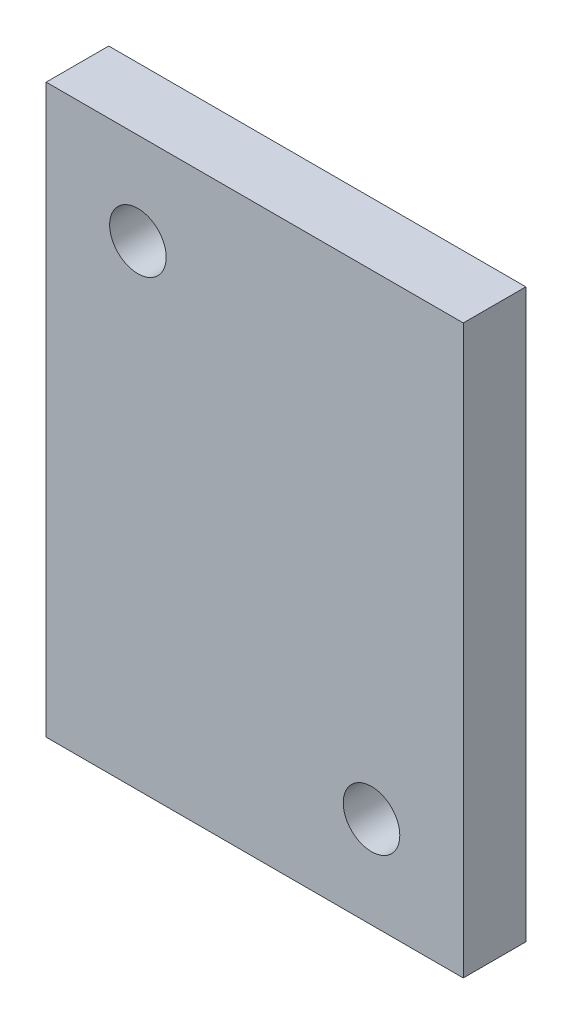
ISO-10303-21;
HEADER;
FILE_DESCRIPTION(('STEP AP214'),'2;1');
FILE_NAME('part.step','',(''),(''),'','','');
FILE_SCHEMA(('AUTOMOTIVE_DESIGN { 1 0 10303 214 1 1 1 1 }'));
ENDSEC;
DATA;
#1=APPLICATION_CONTEXT('core data for automotive mechanical design processes');
#2=APPLICATION_PROTOCOL_DEFINITION('international standard','automotive_design',2000,#1);
#3=PRODUCT_CONTEXT('',#1,'mechanical');
#4=PRODUCT('Part','Part','',(#3));
#5=PRODUCT_RELATED_PRODUCT_CATEGORY('part','',(#4));
#6=PRODUCT_DEFINITION_FORMATION('','',#4);
#7=PRODUCT_DEFINITION_CONTEXT('part definition',#1,'design');
#8=PRODUCT_DEFINITION('design','',#6,#7);
#9=PRODUCT_DEFINITION_SHAPE('','',#8);
#10=(LENGTH_UNIT() NAMED_UNIT(*) SI_UNIT(.MILLI.,.METRE.));
#11=(NAMED_UNIT(*) PLANE_ANGLE_UNIT() SI_UNIT($,.RADIAN.));
#12=(NAMED_UNIT(*) SI_UNIT($,.STERADIAN.) SOLID_ANGLE_UNIT());
#13=UNCERTAINTY_MEASURE_WITH_UNIT(LENGTH_MEASURE(1.E-05),#10,'distance_accuracy_value','');
#14=(GEOMETRIC_REPRESENTATION_CONTEXT(3) GLOBAL_UNCERTAINTY_ASSIGNED_CONTEXT((#13)) GLOBAL_UNIT_ASSIGNED_CONTEXT((#10,
#11,#12)) REPRESENTATION_CONTEXT('',''));
#15=CARTESIAN_POINT('',(0.,0.,0.));
#16=DIRECTION('',(0.,0.,1.));
#17=DIRECTION('',(1.,0.,0.));
#18=AXIS2_PLACEMENT_3D('',#15,#16,#17);
#19=CARTESIAN_POINT('',(-3069.40875716416,1119.82069471238,4.7625));
#20=DIRECTION('',(0.,-1.,0.));
#21=DIRECTION('',(0.,0.,-1.));
#22=AXIS2_PLACEMENT_3D('',#19,#20,#21);
#23=PLANE('',#22);
#24=DIRECTION('',(-1.,0.,0.));
#25=VECTOR('',#24,1.);
#26=CARTESIAN_POINT('',(-3069.40875716416,1119.82069471238,0.));
#27=LINE('',#26,#25);
#28=CARTESIAN_POINT('',(-3069.40875716416,1119.82069471238,0.));
#29=VERTEX_POINT('',#28);
#30=CARTESIAN_POINT('',(-3101.15875716416,1119.82069471238,0.));
#31=VERTEX_POINT('',#30);
#32=EDGE_CURVE('E95',#29,#31,#27,.T.);
#33=ORIENTED_EDGE('',*,*,#32,.T.);
#34=DIRECTION('',(0.,0.,-1.));
#35=VECTOR('',#34,1.);
#36=CARTESIAN_POINT('',(-3101.15875716416,1119.82069471238,4.7625));
#37=LINE('',#36,#35);
#38=CARTESIAN_POINT('',(-3101.15875716416,1119.82069471238,4.7625));
#39=VERTEX_POINT('',#38);
#40=EDGE_CURVE('E11',#39,#31,#37,.T.);
#41=ORIENTED_EDGE('',*,*,#40,.F.);
#42=DIRECTION('',(-1.,0.,0.));
#43=VECTOR('',#42,1.);
#44=CARTESIAN_POINT('',(-3069.40875716416,1119.82069471238,4.7625));
#45=LINE('',#44,#43);
#46=CARTESIAN_POINT('',(-3069.40875716416,1119.82069471238,4.7625));
#47=VERTEX_POINT('',#46);
#48=EDGE_CURVE('E83',#47,#39,#45,.T.);
#49=ORIENTED_EDGE('',*,*,#48,.F.);
#50=DIRECTION('',(0.,0.,-1.));
#51=VECTOR('',#50,1.);
#52=CARTESIAN_POINT('',(-3069.40875716416,1119.82069471238,4.7625));
#53=LINE('',#52,#51);
#54=EDGE_CURVE('E91',#47,#29,#53,.T.);
#55=ORIENTED_EDGE('',*,*,#54,.T.);
#56=EDGE_LOOP('',(#33,#41,#49,#55));
#57=FACE_BOUND('',#56,.T.);
#58=ADVANCED_FACE('F32',(#57),#23,.F.);
#59=CARTESIAN_POINT('',(-3101.15875716416,1119.82069471238,4.7625));
#60=DIRECTION('',(1.,0.,0.));
#61=DIRECTION('',(0.,0.,-1.));
#62=AXIS2_PLACEMENT_3D('',#59,#60,#61);
#63=PLANE('',#62);
#64=DIRECTION('',(0.,-1.,0.));
#65=VECTOR('',#64,1.);
#66=CARTESIAN_POINT('',(-3101.15875716416,1119.82069471238,0.));
#67=LINE('',#66,#65);
#68=CARTESIAN_POINT('',(-3101.15875716416,1076.64069471238,0.));
#69=VERTEX_POINT('',#68);
#70=EDGE_CURVE('E87',#31,#69,#67,.T.);
#71=ORIENTED_EDGE('',*,*,#70,.T.);
#72=DIRECTION('',(0.,0.,-1.));
#73=VECTOR('',#72,1.);
#74=CARTESIAN_POINT('',(-3101.15875716416,1076.64069471238,4.7625));
#75=LINE('',#74,#73);
#76=CARTESIAN_POINT('',(-3101.15875716416,1076.64069471238,4.7625));
#77=VERTEX_POINT('',#76);
#78=EDGE_CURVE('E40',#77,#69,#75,.T.);
#79=ORIENTED_EDGE('',*,*,#78,.F.);
#80=DIRECTION('',(0.,-1.,0.));
#81=VECTOR('',#80,1.);
#82=CARTESIAN_POINT('',(-3101.15875716416,1119.82069471238,4.7625));
#83=LINE('',#82,#81);
#84=EDGE_CURVE('E78',#39,#77,#83,.T.);
#85=ORIENTED_EDGE('',*,*,#84,.F.);
#86=ORIENTED_EDGE('',*,*,#40,.T.);
#87=EDGE_LOOP('',(#71,#79,#85,#86));
#88=FACE_BOUND('',#87,.T.);
#89=ADVANCED_FACE('F86',(#88),#63,.F.);
#90=CARTESIAN_POINT('',(-3101.15875716416,1076.64069471238,4.7625));
#91=DIRECTION('',(0.,1.,0.));
#92=DIRECTION('',(0.,0.,1.));
#93=AXIS2_PLACEMENT_3D('',#90,#91,#92);
#94=PLANE('',#93);
#95=DIRECTION('',(1.,0.,0.));
#96=VECTOR('',#95,1.);
#97=CARTESIAN_POINT('',(-3101.15875716416,1076.64069471238,0.));
#98=LINE('',#97,#96);
#99=CARTESIAN_POINT('',(-3069.40875716416,1076.64069471238,0.));
#100=VERTEX_POINT('',#99);
#101=EDGE_CURVE('E65',#69,#100,#98,.T.);
#102=ORIENTED_EDGE('',*,*,#101,.T.);
#103=DIRECTION('',(0.,0.,-1.));
#104=VECTOR('',#103,1.);
#105=CARTESIAN_POINT('',(-3069.40875716416,1076.64069471238,4.7625));
#106=LINE('',#105,#104);
#107=CARTESIAN_POINT('',(-3069.40875716416,1076.64069471238,4.7625));
#108=VERTEX_POINT('',#107);
#109=EDGE_CURVE('E88',#108,#100,#106,.T.);
#110=ORIENTED_EDGE('',*,*,#109,.F.);
#111=DIRECTION('',(1.,0.,0.));
#112=VECTOR('',#111,1.);
#113=CARTESIAN_POINT('',(-3101.15875716416,1076.64069471238,4.7625));
#114=LINE('',#113,#112);
#115=EDGE_CURVE('E81',#77,#108,#114,.T.);
#116=ORIENTED_EDGE('',*,*,#115,.F.);
#117=ORIENTED_EDGE('',*,*,#78,.T.);
#118=EDGE_LOOP('',(#102,#110,#116,#117));
#119=FACE_BOUND('',#118,.T.);
#120=ADVANCED_FACE('F89',(#119),#94,.F.);
#121=CARTESIAN_POINT('',(-3069.40875716416,1076.64069471238,4.7625));
#122=DIRECTION('',(-1.,0.,0.));
#123=DIRECTION('',(0.,0.,1.));
#124=AXIS2_PLACEMENT_3D('',#121,#122,#123);
#125=PLANE('',#124);
#126=DIRECTION('',(0.,1.,0.));
#127=VECTOR('',#126,1.);
#128=CARTESIAN_POINT('',(-3069.40875716416,1076.64069471238,0.));
#129=LINE('',#128,#127);
#130=EDGE_CURVE('E71',#100,#29,#129,.T.);
#131=ORIENTED_EDGE('',*,*,#130,.T.);
#132=ORIENTED_EDGE('',*,*,#54,.F.);
#133=DIRECTION('',(0.,1.,0.));
#134=VECTOR('',#133,1.);
#135=CARTESIAN_POINT('',(-3069.40875716416,1076.64069471238,4.7625));
#136=LINE('',#135,#134);
#137=EDGE_CURVE('E48',#108,#47,#136,.T.);
#138=ORIENTED_EDGE('',*,*,#137,.F.);
#139=ORIENTED_EDGE('',*,*,#109,.T.);
#140=EDGE_LOOP('',(#131,#132,#138,#139));
#141=FACE_BOUND('',#140,.T.);
#142=ADVANCED_FACE('F103',(#141),#125,.F.);
#143=CARTESIAN_POINT('',(0.,0.,4.7625));
#144=DIRECTION('',(0.,0.,1.));
#145=DIRECTION('',(1.,0.,0.));
#146=AXIS2_PLACEMENT_3D('',#143,#144,#145);
#147=PLANE('',#146);
#148=CARTESIAN_POINT('',(-3076.39375716416,1083.62569471238,4.7625));
#149=DIRECTION('',(0.,0.,1.));
#150=DIRECTION('',(1.,0.,0.));
#151=AXIS2_PLACEMENT_3D('',#148,#149,#150);
#152=CIRCLE('',#151,2.1526500000002);
#153=CARTESIAN_POINT('',(-3074.24110716416,1083.62569471238,4.7625));
#154=VERTEX_POINT('',#153);
#155=EDGE_CURVE('E117',#154,#154,#152,.T.);
#156=ORIENTED_EDGE('',*,*,#155,.F.);
#157=EDGE_LOOP('',(#156));
#158=FACE_BOUND('',#157,.T.);
#159=CARTESIAN_POINT('',(-3094.17375716416,1112.83569471238,4.7625));
#160=DIRECTION('',(0.,0.,1.));
#161=DIRECTION('',(1.,0.,0.));
#162=AXIS2_PLACEMENT_3D('',#159,#160,#161);
#163=CIRCLE('',#162,2.1526500000002);
#164=CARTESIAN_POINT('',(-3092.02110716416,1112.83569471238,4.7625));
#165=VERTEX_POINT('',#164);
#166=EDGE_CURVE('E111',#165,#165,#163,.T.);
#167=ORIENTED_EDGE('',*,*,#166,.F.);
#168=EDGE_LOOP('',(#167));
#169=FACE_BOUND('',#168,.T.);
#170=ORIENTED_EDGE('',*,*,#48,.T.);
#171=ORIENTED_EDGE('',*,*,#84,.T.);
#172=ORIENTED_EDGE('',*,*,#115,.T.);
#173=ORIENTED_EDGE('',*,*,#137,.T.);
#174=EDGE_LOOP('',(#170,#171,#172,#173));
#175=FACE_BOUND('',#174,.T.);
#176=ADVANCED_FACE('F79',(#158,#169,#175),#147,.T.);
#177=CARTESIAN_POINT('',(0.,0.,0.));
#178=DIRECTION('',(0.,0.,1.));
#179=DIRECTION('',(1.,0.,0.));
#180=AXIS2_PLACEMENT_3D('',#177,#178,#179);
#181=PLANE('',#180);
#182=CARTESIAN_POINT('',(-3076.39375716416,1083.62569471238,0.));
#183=DIRECTION('',(0.,0.,1.));
#184=DIRECTION('',(1.,0.,0.));
#185=AXIS2_PLACEMENT_3D('',#182,#183,#184);
#186=CIRCLE('',#185,2.1526500000002);
#187=CARTESIAN_POINT('',(-3074.24110716416,1083.62569471238,0.));
#188=VERTEX_POINT('',#187);
#189=EDGE_CURVE('E114',#188,#188,#186,.T.);
#190=ORIENTED_EDGE('',*,*,#189,.T.);
#191=EDGE_LOOP('',(#190));
#192=FACE_BOUND('',#191,.T.);
#193=CARTESIAN_POINT('',(-3094.17375716416,1112.83569471238,0.));
#194=DIRECTION('',(0.,0.,1.));
#195=DIRECTION('',(1.,0.,0.));
#196=AXIS2_PLACEMENT_3D('',#193,#194,#195);
#197=CIRCLE('',#196,2.1526500000002);
#198=CARTESIAN_POINT('',(-3092.02110716416,1112.83569471238,0.));
#199=VERTEX_POINT('',#198);
#200=EDGE_CURVE('E98',#199,#199,#197,.T.);
#201=ORIENTED_EDGE('',*,*,#200,.T.);
#202=EDGE_LOOP('',(#201));
#203=FACE_BOUND('',#202,.T.);
#204=ORIENTED_EDGE('',*,*,#32,.F.);
#205=ORIENTED_EDGE('',*,*,#130,.F.);
#206=ORIENTED_EDGE('',*,*,#101,.F.);
#207=ORIENTED_EDGE('',*,*,#70,.F.);
#208=EDGE_LOOP('',(#204,#205,#206,#207));
#209=FACE_BOUND('',#208,.T.);
#210=ADVANCED_FACE('F106',(#192,#203,#209),#181,.F.);
#211=CARTESIAN_POINT('',(-3094.17375716416,1112.83569471238,4.7625));
#212=DIRECTION('',(0.,0.,1.));
#213=DIRECTION('',(1.,0.,0.));
#214=AXIS2_PLACEMENT_3D('',#211,#212,#213);
#215=CYLINDRICAL_SURFACE('',#214,2.1526500000002);
#216=ORIENTED_EDGE('',*,*,#200,.F.);
#217=EDGE_LOOP('',(#216));
#218=FACE_BOUND('',#217,.T.);
#219=ORIENTED_EDGE('',*,*,#166,.T.);
#220=EDGE_LOOP('',(#219));
#221=FACE_BOUND('',#220,.T.);
#222=ADVANCED_FACE('F128',(#218,#221),#215,.F.);
#223=CARTESIAN_POINT('',(-3076.39375716416,1083.62569471238,4.7625));
#224=DIRECTION('',(0.,0.,1.));
#225=DIRECTION('',(1.,0.,0.));
#226=AXIS2_PLACEMENT_3D('',#223,#224,#225);
#227=CYLINDRICAL_SURFACE('',#226,2.1526500000002);
#228=ORIENTED_EDGE('',*,*,#189,.F.);
#229=EDGE_LOOP('',(#228));
#230=FACE_BOUND('',#229,.T.);
#231=ORIENTED_EDGE('',*,*,#155,.T.);
#232=EDGE_LOOP('',(#231));
#233=FACE_BOUND('',#232,.T.);
#234=ADVANCED_FACE('F121',(#230,#233),#227,.F.);
#235=CLOSED_SHELL('',(#58,#89,#120,#142,#176,#210,#222,#234));
#236=MANIFOLD_SOLID_BREP('B2',#235);
#237=ADVANCED_BREP_SHAPE_REPRESENTATION('',(#18,#236),#14);
#238=SHAPE_DEFINITION_REPRESENTATION(#9,#237);
ENDSEC;
END-ISO-10303-21;
